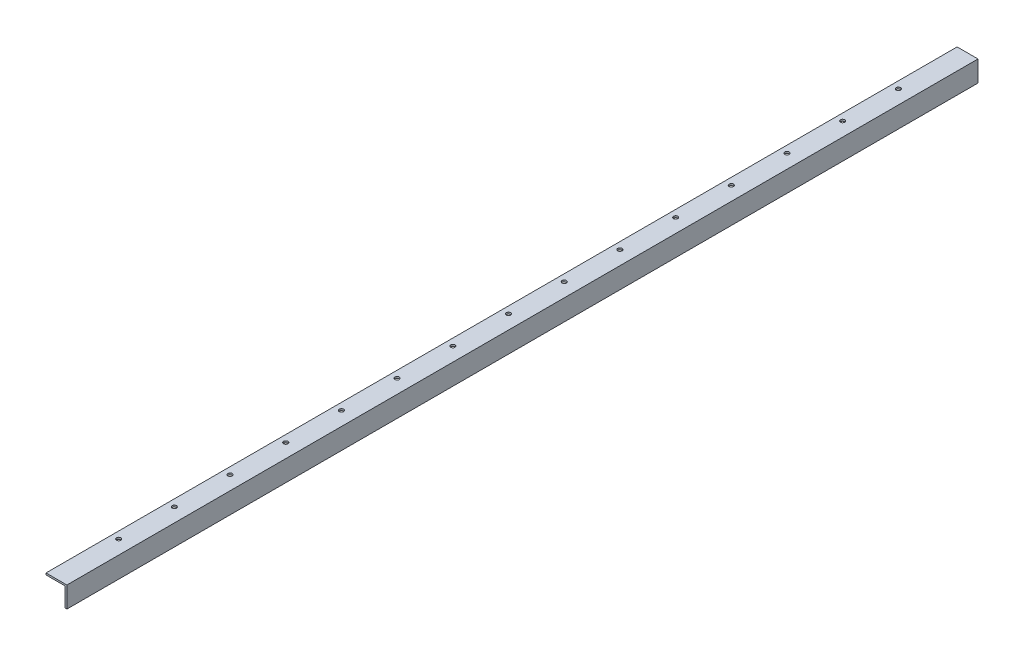
ISO-10303-21;
HEADER;
FILE_DESCRIPTION(('STEP AP214'),'2;1');
FILE_NAME('part.step','',(''),(''),'','','');
FILE_SCHEMA(('AUTOMOTIVE_DESIGN { 1 0 10303 214 1 1 1 1 }'));
ENDSEC;
DATA;
#1=APPLICATION_CONTEXT('core data for automotive mechanical design processes');
#2=APPLICATION_PROTOCOL_DEFINITION('international standard','automotive_design',2000,#1);
#3=PRODUCT_CONTEXT('',#1,'mechanical');
#4=PRODUCT('Part','Part','',(#3));
#5=PRODUCT_RELATED_PRODUCT_CATEGORY('part','',(#4));
#6=PRODUCT_DEFINITION_FORMATION('','',#4);
#7=PRODUCT_DEFINITION_CONTEXT('part definition',#1,'design');
#8=PRODUCT_DEFINITION('design','',#6,#7);
#9=PRODUCT_DEFINITION_SHAPE('','',#8);
#10=(LENGTH_UNIT() NAMED_UNIT(*) SI_UNIT(.MILLI.,.METRE.));
#11=(NAMED_UNIT(*) PLANE_ANGLE_UNIT() SI_UNIT($,.RADIAN.));
#12=(NAMED_UNIT(*) SI_UNIT($,.STERADIAN.) SOLID_ANGLE_UNIT());
#13=UNCERTAINTY_MEASURE_WITH_UNIT(LENGTH_MEASURE(1.E-05),#10,'distance_accuracy_value','');
#14=(GEOMETRIC_REPRESENTATION_CONTEXT(3) GLOBAL_UNCERTAINTY_ASSIGNED_CONTEXT((#13)) GLOBAL_UNIT_ASSIGNED_CONTEXT((#10,
#11,#12)) REPRESENTATION_CONTEXT('',''));
#15=CARTESIAN_POINT('',(0.,0.,0.));
#16=DIRECTION('',(0.,0.,1.));
#17=DIRECTION('',(1.,0.,0.));
#18=AXIS2_PLACEMENT_3D('',#15,#16,#17);
#19=CARTESIAN_POINT('',(-25.4,-41.275,1542.25625));
#20=DIRECTION('',(0.,1.,0.));
#21=DIRECTION('',(0.,0.,1.));
#22=AXIS2_PLACEMENT_3D('',#19,#20,#21);
#23=CYLINDRICAL_SURFACE('',#22,3.96874999999999);
#24=CARTESIAN_POINT('',(-25.4,-3.175,1542.25625));
#25=DIRECTION('',(0.,1.,0.));
#26=DIRECTION('',(0.,0.,1.));
#27=AXIS2_PLACEMENT_3D('',#24,#25,#26);
#28=CIRCLE('',#27,3.96874999999999);
#29=CARTESIAN_POINT('',(-25.4,-3.175,1546.225));
#30=VERTEX_POINT('',#29);
#31=EDGE_CURVE('E41',#30,#30,#28,.T.);
#32=ORIENTED_EDGE('',*,*,#31,.F.);
#33=EDGE_LOOP('',(#32));
#34=FACE_BOUND('',#33,.T.);
#35=CARTESIAN_POINT('',(-25.4,0.,1542.25625));
#36=DIRECTION('',(0.,-1.,0.));
#37=DIRECTION('',(1.,0.,0.));
#38=AXIS2_PLACEMENT_3D('',#35,#36,#37);
#39=CIRCLE('',#38,3.96874999999999);
#40=CARTESIAN_POINT('',(-21.43125,0.,1542.25625));
#41=VERTEX_POINT('',#40);
#42=EDGE_CURVE('E11',#41,#41,#39,.T.);
#43=ORIENTED_EDGE('',*,*,#42,.F.);
#44=EDGE_LOOP('',(#43));
#45=FACE_BOUND('',#44,.T.);
#46=ADVANCED_FACE('F33',(#34,#45),#23,.F.);
#47=CARTESIAN_POINT('',(-25.4,-41.275,1440.65625));
#48=DIRECTION('',(0.,1.,0.));
#49=DIRECTION('',(0.,0.,1.));
#50=AXIS2_PLACEMENT_3D('',#47,#48,#49);
#51=CYLINDRICAL_SURFACE('',#50,3.96874999999999);
#52=CARTESIAN_POINT('',(-25.4,-3.175,1440.65625));
#53=DIRECTION('',(0.,1.,0.));
#54=DIRECTION('',(0.,0.,1.));
#55=AXIS2_PLACEMENT_3D('',#52,#53,#54);
#56=CIRCLE('',#55,3.96874999999999);
#57=CARTESIAN_POINT('',(-25.4,-3.175,1444.625));
#58=VERTEX_POINT('',#57);
#59=EDGE_CURVE('E209',#58,#58,#56,.T.);
#60=ORIENTED_EDGE('',*,*,#59,.F.);
#61=EDGE_LOOP('',(#60));
#62=FACE_BOUND('',#61,.T.);
#63=CARTESIAN_POINT('',(-25.4,0.,1440.65625));
#64=DIRECTION('',(0.,-1.,0.));
#65=DIRECTION('',(1.,0.,0.));
#66=AXIS2_PLACEMENT_3D('',#63,#64,#65);
#67=CIRCLE('',#66,3.96874999999999);
#68=CARTESIAN_POINT('',(-21.43125,0.,1440.65625));
#69=VERTEX_POINT('',#68);
#70=EDGE_CURVE('E212',#69,#69,#67,.T.);
#71=ORIENTED_EDGE('',*,*,#70,.F.);
#72=EDGE_LOOP('',(#71));
#73=FACE_BOUND('',#72,.T.);
#74=ADVANCED_FACE('F220',(#62,#73),#51,.F.);
#75=CARTESIAN_POINT('',(-25.4,-41.275,1339.05625));
#76=DIRECTION('',(0.,1.,0.));
#77=DIRECTION('',(0.,0.,1.));
#78=AXIS2_PLACEMENT_3D('',#75,#76,#77);
#79=CYLINDRICAL_SURFACE('',#78,3.96874999999999);
#80=CARTESIAN_POINT('',(-25.4,-3.175,1339.05625));
#81=DIRECTION('',(0.,1.,0.));
#82=DIRECTION('',(0.,0.,1.));
#83=AXIS2_PLACEMENT_3D('',#80,#81,#82);
#84=CIRCLE('',#83,3.96874999999999);
#85=CARTESIAN_POINT('',(-25.4,-3.175,1343.025));
#86=VERTEX_POINT('',#85);
#87=EDGE_CURVE('E203',#86,#86,#84,.T.);
#88=ORIENTED_EDGE('',*,*,#87,.F.);
#89=EDGE_LOOP('',(#88));
#90=FACE_BOUND('',#89,.T.);
#91=CARTESIAN_POINT('',(-25.4,0.,1339.05625));
#92=DIRECTION('',(0.,-1.,0.));
#93=DIRECTION('',(1.,0.,0.));
#94=AXIS2_PLACEMENT_3D('',#91,#92,#93);
#95=CIRCLE('',#94,3.96874999999999);
#96=CARTESIAN_POINT('',(-21.43125,0.,1339.05625));
#97=VERTEX_POINT('',#96);
#98=EDGE_CURVE('E206',#97,#97,#95,.T.);
#99=ORIENTED_EDGE('',*,*,#98,.F.);
#100=EDGE_LOOP('',(#99));
#101=FACE_BOUND('',#100,.T.);
#102=ADVANCED_FACE('F280',(#90,#101),#79,.F.);
#103=CARTESIAN_POINT('',(-25.4,-41.275,1237.45625));
#104=DIRECTION('',(0.,1.,0.));
#105=DIRECTION('',(0.,0.,1.));
#106=AXIS2_PLACEMENT_3D('',#103,#104,#105);
#107=CYLINDRICAL_SURFACE('',#106,3.96874999999999);
#108=CARTESIAN_POINT('',(-25.4,-3.175,1237.45625));
#109=DIRECTION('',(0.,1.,0.));
#110=DIRECTION('',(0.,0.,1.));
#111=AXIS2_PLACEMENT_3D('',#108,#109,#110);
#112=CIRCLE('',#111,3.96874999999999);
#113=CARTESIAN_POINT('',(-25.4,-3.175,1241.425));
#114=VERTEX_POINT('',#113);
#115=EDGE_CURVE('E197',#114,#114,#112,.T.);
#116=ORIENTED_EDGE('',*,*,#115,.F.);
#117=EDGE_LOOP('',(#116));
#118=FACE_BOUND('',#117,.T.);
#119=CARTESIAN_POINT('',(-25.4,0.,1237.45625));
#120=DIRECTION('',(0.,-1.,0.));
#121=DIRECTION('',(1.,0.,0.));
#122=AXIS2_PLACEMENT_3D('',#119,#120,#121);
#123=CIRCLE('',#122,3.96874999999999);
#124=CARTESIAN_POINT('',(-21.43125,0.,1237.45625));
#125=VERTEX_POINT('',#124);
#126=EDGE_CURVE('E200',#125,#125,#123,.T.);
#127=ORIENTED_EDGE('',*,*,#126,.F.);
#128=EDGE_LOOP('',(#127));
#129=FACE_BOUND('',#128,.T.);
#130=ADVANCED_FACE('F276',(#118,#129),#107,.F.);
#131=CARTESIAN_POINT('',(-25.4,-41.275,1135.85625));
#132=DIRECTION('',(0.,1.,0.));
#133=DIRECTION('',(0.,0.,1.));
#134=AXIS2_PLACEMENT_3D('',#131,#132,#133);
#135=CYLINDRICAL_SURFACE('',#134,3.96874999999999);
#136=CARTESIAN_POINT('',(-25.4,-3.175,1135.85625));
#137=DIRECTION('',(0.,1.,0.));
#138=DIRECTION('',(0.,0.,1.));
#139=AXIS2_PLACEMENT_3D('',#136,#137,#138);
#140=CIRCLE('',#139,3.96874999999999);
#141=CARTESIAN_POINT('',(-25.4,-3.175,1139.825));
#142=VERTEX_POINT('',#141);
#143=EDGE_CURVE('E191',#142,#142,#140,.T.);
#144=ORIENTED_EDGE('',*,*,#143,.F.);
#145=EDGE_LOOP('',(#144));
#146=FACE_BOUND('',#145,.T.);
#147=CARTESIAN_POINT('',(-25.4,0.,1135.85625));
#148=DIRECTION('',(0.,-1.,0.));
#149=DIRECTION('',(1.,0.,0.));
#150=AXIS2_PLACEMENT_3D('',#147,#148,#149);
#151=CIRCLE('',#150,3.96874999999999);
#152=CARTESIAN_POINT('',(-21.43125,0.,1135.85625));
#153=VERTEX_POINT('',#152);
#154=EDGE_CURVE('E194',#153,#153,#151,.T.);
#155=ORIENTED_EDGE('',*,*,#154,.F.);
#156=EDGE_LOOP('',(#155));
#157=FACE_BOUND('',#156,.T.);
#158=ADVANCED_FACE('F272',(#146,#157),#135,.F.);
#159=CARTESIAN_POINT('',(-25.4,-41.275,1034.25625));
#160=DIRECTION('',(0.,1.,0.));
#161=DIRECTION('',(0.,0.,1.));
#162=AXIS2_PLACEMENT_3D('',#159,#160,#161);
#163=CYLINDRICAL_SURFACE('',#162,3.96874999999999);
#164=CARTESIAN_POINT('',(-25.4,-3.175,1034.25625));
#165=DIRECTION('',(0.,1.,0.));
#166=DIRECTION('',(0.,0.,1.));
#167=AXIS2_PLACEMENT_3D('',#164,#165,#166);
#168=CIRCLE('',#167,3.96874999999999);
#169=CARTESIAN_POINT('',(-25.4,-3.175,1038.225));
#170=VERTEX_POINT('',#169);
#171=EDGE_CURVE('E185',#170,#170,#168,.T.);
#172=ORIENTED_EDGE('',*,*,#171,.F.);
#173=EDGE_LOOP('',(#172));
#174=FACE_BOUND('',#173,.T.);
#175=CARTESIAN_POINT('',(-25.4,0.,1034.25625));
#176=DIRECTION('',(0.,-1.,0.));
#177=DIRECTION('',(1.,0.,0.));
#178=AXIS2_PLACEMENT_3D('',#175,#176,#177);
#179=CIRCLE('',#178,3.96874999999999);
#180=CARTESIAN_POINT('',(-21.43125,0.,1034.25625));
#181=VERTEX_POINT('',#180);
#182=EDGE_CURVE('E188',#181,#181,#179,.T.);
#183=ORIENTED_EDGE('',*,*,#182,.F.);
#184=EDGE_LOOP('',(#183));
#185=FACE_BOUND('',#184,.T.);
#186=ADVANCED_FACE('F268',(#174,#185),#163,.F.);
#187=CARTESIAN_POINT('',(-25.4,-41.275,932.65625));
#188=DIRECTION('',(0.,1.,0.));
#189=DIRECTION('',(0.,0.,1.));
#190=AXIS2_PLACEMENT_3D('',#187,#188,#189);
#191=CYLINDRICAL_SURFACE('',#190,3.96874999999999);
#192=CARTESIAN_POINT('',(-25.4,-3.175,932.65625));
#193=DIRECTION('',(0.,1.,0.));
#194=DIRECTION('',(0.,0.,1.));
#195=AXIS2_PLACEMENT_3D('',#192,#193,#194);
#196=CIRCLE('',#195,3.96874999999999);
#197=CARTESIAN_POINT('',(-25.4,-3.175,936.625));
#198=VERTEX_POINT('',#197);
#199=EDGE_CURVE('E179',#198,#198,#196,.T.);
#200=ORIENTED_EDGE('',*,*,#199,.F.);
#201=EDGE_LOOP('',(#200));
#202=FACE_BOUND('',#201,.T.);
#203=CARTESIAN_POINT('',(-25.4,0.,932.65625));
#204=DIRECTION('',(0.,-1.,0.));
#205=DIRECTION('',(1.,0.,0.));
#206=AXIS2_PLACEMENT_3D('',#203,#204,#205);
#207=CIRCLE('',#206,3.96874999999999);
#208=CARTESIAN_POINT('',(-21.43125,0.,932.65625));
#209=VERTEX_POINT('',#208);
#210=EDGE_CURVE('E182',#209,#209,#207,.T.);
#211=ORIENTED_EDGE('',*,*,#210,.F.);
#212=EDGE_LOOP('',(#211));
#213=FACE_BOUND('',#212,.T.);
#214=ADVANCED_FACE('F264',(#202,#213),#191,.F.);
#215=CARTESIAN_POINT('',(-25.4,-41.275,831.05625));
#216=DIRECTION('',(0.,1.,0.));
#217=DIRECTION('',(0.,0.,1.));
#218=AXIS2_PLACEMENT_3D('',#215,#216,#217);
#219=CYLINDRICAL_SURFACE('',#218,3.96874999999999);
#220=CARTESIAN_POINT('',(-25.4,-3.175,831.05625));
#221=DIRECTION('',(0.,1.,0.));
#222=DIRECTION('',(0.,0.,1.));
#223=AXIS2_PLACEMENT_3D('',#220,#221,#222);
#224=CIRCLE('',#223,3.96874999999999);
#225=CARTESIAN_POINT('',(-25.4,-3.175,835.025));
#226=VERTEX_POINT('',#225);
#227=EDGE_CURVE('E173',#226,#226,#224,.T.);
#228=ORIENTED_EDGE('',*,*,#227,.F.);
#229=EDGE_LOOP('',(#228));
#230=FACE_BOUND('',#229,.T.);
#231=CARTESIAN_POINT('',(-25.4,0.,831.05625));
#232=DIRECTION('',(0.,-1.,0.));
#233=DIRECTION('',(1.,0.,0.));
#234=AXIS2_PLACEMENT_3D('',#231,#232,#233);
#235=CIRCLE('',#234,3.96874999999999);
#236=CARTESIAN_POINT('',(-21.43125,0.,831.05625));
#237=VERTEX_POINT('',#236);
#238=EDGE_CURVE('E176',#237,#237,#235,.T.);
#239=ORIENTED_EDGE('',*,*,#238,.F.);
#240=EDGE_LOOP('',(#239));
#241=FACE_BOUND('',#240,.T.);
#242=ADVANCED_FACE('F260',(#230,#241),#219,.F.);
#243=CARTESIAN_POINT('',(-25.4,-41.275,729.45625));
#244=DIRECTION('',(0.,1.,0.));
#245=DIRECTION('',(0.,0.,1.));
#246=AXIS2_PLACEMENT_3D('',#243,#244,#245);
#247=CYLINDRICAL_SURFACE('',#246,3.96874999999999);
#248=CARTESIAN_POINT('',(-25.4,-3.175,729.45625));
#249=DIRECTION('',(0.,1.,0.));
#250=DIRECTION('',(0.,0.,1.));
#251=AXIS2_PLACEMENT_3D('',#248,#249,#250);
#252=CIRCLE('',#251,3.96874999999999);
#253=CARTESIAN_POINT('',(-25.4,-3.175,733.425));
#254=VERTEX_POINT('',#253);
#255=EDGE_CURVE('E167',#254,#254,#252,.T.);
#256=ORIENTED_EDGE('',*,*,#255,.F.);
#257=EDGE_LOOP('',(#256));
#258=FACE_BOUND('',#257,.T.);
#259=CARTESIAN_POINT('',(-25.4,0.,729.45625));
#260=DIRECTION('',(0.,-1.,0.));
#261=DIRECTION('',(1.,0.,0.));
#262=AXIS2_PLACEMENT_3D('',#259,#260,#261);
#263=CIRCLE('',#262,3.96874999999999);
#264=CARTESIAN_POINT('',(-21.43125,0.,729.45625));
#265=VERTEX_POINT('',#264);
#266=EDGE_CURVE('E170',#265,#265,#263,.T.);
#267=ORIENTED_EDGE('',*,*,#266,.F.);
#268=EDGE_LOOP('',(#267));
#269=FACE_BOUND('',#268,.T.);
#270=ADVANCED_FACE('F256',(#258,#269),#247,.F.);
#271=CARTESIAN_POINT('',(-25.4,-41.275,627.85625));
#272=DIRECTION('',(0.,1.,0.));
#273=DIRECTION('',(0.,0.,1.));
#274=AXIS2_PLACEMENT_3D('',#271,#272,#273);
#275=CYLINDRICAL_SURFACE('',#274,3.96874999999999);
#276=CARTESIAN_POINT('',(-25.4,-3.175,627.85625));
#277=DIRECTION('',(0.,1.,0.));
#278=DIRECTION('',(0.,0.,1.));
#279=AXIS2_PLACEMENT_3D('',#276,#277,#278);
#280=CIRCLE('',#279,3.96874999999999);
#281=CARTESIAN_POINT('',(-25.4,-3.175,631.825));
#282=VERTEX_POINT('',#281);
#283=EDGE_CURVE('E161',#282,#282,#280,.T.);
#284=ORIENTED_EDGE('',*,*,#283,.F.);
#285=EDGE_LOOP('',(#284));
#286=FACE_BOUND('',#285,.T.);
#287=CARTESIAN_POINT('',(-25.4,0.,627.85625));
#288=DIRECTION('',(0.,-1.,0.));
#289=DIRECTION('',(1.,0.,0.));
#290=AXIS2_PLACEMENT_3D('',#287,#288,#289);
#291=CIRCLE('',#290,3.96874999999999);
#292=CARTESIAN_POINT('',(-21.43125,0.,627.85625));
#293=VERTEX_POINT('',#292);
#294=EDGE_CURVE('E164',#293,#293,#291,.T.);
#295=ORIENTED_EDGE('',*,*,#294,.F.);
#296=EDGE_LOOP('',(#295));
#297=FACE_BOUND('',#296,.T.);
#298=ADVANCED_FACE('F252',(#286,#297),#275,.F.);
#299=CARTESIAN_POINT('',(-25.4,-41.275,526.25625));
#300=DIRECTION('',(0.,1.,0.));
#301=DIRECTION('',(0.,0.,1.));
#302=AXIS2_PLACEMENT_3D('',#299,#300,#301);
#303=CYLINDRICAL_SURFACE('',#302,3.96874999999999);
#304=CARTESIAN_POINT('',(-25.4,-3.175,526.25625));
#305=DIRECTION('',(0.,1.,0.));
#306=DIRECTION('',(0.,0.,1.));
#307=AXIS2_PLACEMENT_3D('',#304,#305,#306);
#308=CIRCLE('',#307,3.96874999999999);
#309=CARTESIAN_POINT('',(-25.4,-3.175,530.225));
#310=VERTEX_POINT('',#309);
#311=EDGE_CURVE('E155',#310,#310,#308,.T.);
#312=ORIENTED_EDGE('',*,*,#311,.F.);
#313=EDGE_LOOP('',(#312));
#314=FACE_BOUND('',#313,.T.);
#315=CARTESIAN_POINT('',(-25.4,0.,526.25625));
#316=DIRECTION('',(0.,-1.,0.));
#317=DIRECTION('',(1.,0.,0.));
#318=AXIS2_PLACEMENT_3D('',#315,#316,#317);
#319=CIRCLE('',#318,3.96874999999999);
#320=CARTESIAN_POINT('',(-21.43125,0.,526.25625));
#321=VERTEX_POINT('',#320);
#322=EDGE_CURVE('E158',#321,#321,#319,.T.);
#323=ORIENTED_EDGE('',*,*,#322,.F.);
#324=EDGE_LOOP('',(#323));
#325=FACE_BOUND('',#324,.T.);
#326=ADVANCED_FACE('F248',(#314,#325),#303,.F.);
#327=CARTESIAN_POINT('',(-25.4,-41.275,424.65625));
#328=DIRECTION('',(0.,1.,0.));
#329=DIRECTION('',(0.,0.,1.));
#330=AXIS2_PLACEMENT_3D('',#327,#328,#329);
#331=CYLINDRICAL_SURFACE('',#330,3.96874999999999);
#332=CARTESIAN_POINT('',(-25.4,-3.175,424.65625));
#333=DIRECTION('',(0.,1.,0.));
#334=DIRECTION('',(0.,0.,1.));
#335=AXIS2_PLACEMENT_3D('',#332,#333,#334);
#336=CIRCLE('',#335,3.96874999999999);
#337=CARTESIAN_POINT('',(-25.4,-3.175,428.625));
#338=VERTEX_POINT('',#337);
#339=EDGE_CURVE('E149',#338,#338,#336,.T.);
#340=ORIENTED_EDGE('',*,*,#339,.F.);
#341=EDGE_LOOP('',(#340));
#342=FACE_BOUND('',#341,.T.);
#343=CARTESIAN_POINT('',(-25.4,0.,424.65625));
#344=DIRECTION('',(0.,-1.,0.));
#345=DIRECTION('',(1.,0.,0.));
#346=AXIS2_PLACEMENT_3D('',#343,#344,#345);
#347=CIRCLE('',#346,3.96874999999999);
#348=CARTESIAN_POINT('',(-21.43125,0.,424.65625));
#349=VERTEX_POINT('',#348);
#350=EDGE_CURVE('E152',#349,#349,#347,.T.);
#351=ORIENTED_EDGE('',*,*,#350,.F.);
#352=EDGE_LOOP('',(#351));
#353=FACE_BOUND('',#352,.T.);
#354=ADVANCED_FACE('F244',(#342,#353),#331,.F.);
#355=CARTESIAN_POINT('',(-25.4,-41.275,323.05625));
#356=DIRECTION('',(0.,1.,0.));
#357=DIRECTION('',(0.,0.,1.));
#358=AXIS2_PLACEMENT_3D('',#355,#356,#357);
#359=CYLINDRICAL_SURFACE('',#358,3.96874999999999);
#360=CARTESIAN_POINT('',(-25.4,-3.175,323.05625));
#361=DIRECTION('',(0.,1.,0.));
#362=DIRECTION('',(0.,0.,1.));
#363=AXIS2_PLACEMENT_3D('',#360,#361,#362);
#364=CIRCLE('',#363,3.96874999999999);
#365=CARTESIAN_POINT('',(-25.4,-3.175,327.025));
#366=VERTEX_POINT('',#365);
#367=EDGE_CURVE('E139',#366,#366,#364,.T.);
#368=ORIENTED_EDGE('',*,*,#367,.F.);
#369=EDGE_LOOP('',(#368));
#370=FACE_BOUND('',#369,.T.);
#371=CARTESIAN_POINT('',(-25.4,0.,323.05625));
#372=DIRECTION('',(0.,-1.,0.));
#373=DIRECTION('',(1.,0.,0.));
#374=AXIS2_PLACEMENT_3D('',#371,#372,#373);
#375=CIRCLE('',#374,3.96874999999999);
#376=CARTESIAN_POINT('',(-21.43125,0.,323.05625));
#377=VERTEX_POINT('',#376);
#378=EDGE_CURVE('E146',#377,#377,#375,.T.);
#379=ORIENTED_EDGE('',*,*,#378,.F.);
#380=EDGE_LOOP('',(#379));
#381=FACE_BOUND('',#380,.T.);
#382=ADVANCED_FACE('F235',(#370,#381),#359,.F.);
#383=CARTESIAN_POINT('',(0.,-38.1,1662.1125));
#384=DIRECTION('',(-1.,0.,0.));
#385=DIRECTION('',(0.,0.,1.));
#386=AXIS2_PLACEMENT_3D('',#383,#384,#385);
#387=PLANE('',#386);
#388=DIRECTION('',(0.,1.,0.));
#389=VECTOR('',#388,1.);
#390=CARTESIAN_POINT('',(0.,-38.1,0.));
#391=LINE('',#390,#389);
#392=CARTESIAN_POINT('',(0.,-38.1,0.));
#393=VERTEX_POINT('',#392);
#394=CARTESIAN_POINT('',(0.,0.,0.));
#395=VERTEX_POINT('',#394);
#396=EDGE_CURVE('E119',#393,#395,#391,.T.);
#397=ORIENTED_EDGE('',*,*,#396,.T.);
#398=DIRECTION('',(0.,0.,-1.));
#399=VECTOR('',#398,1.);
#400=CARTESIAN_POINT('',(0.,0.,1662.1125));
#401=LINE('',#400,#399);
#402=CARTESIAN_POINT('',(0.,0.,1662.1125));
#403=VERTEX_POINT('',#402);
#404=EDGE_CURVE('E137',#403,#395,#401,.T.);
#405=ORIENTED_EDGE('',*,*,#404,.F.);
#406=DIRECTION('',(0.,1.,0.));
#407=VECTOR('',#406,1.);
#408=CARTESIAN_POINT('',(0.,-38.1,1662.1125));
#409=LINE('',#408,#407);
#410=CARTESIAN_POINT('',(0.,-38.1,1662.1125));
#411=VERTEX_POINT('',#410);
#412=EDGE_CURVE('E130',#411,#403,#409,.T.);
#413=ORIENTED_EDGE('',*,*,#412,.F.);
#414=DIRECTION('',(0.,0.,-1.));
#415=VECTOR('',#414,1.);
#416=CARTESIAN_POINT('',(0.,-38.1,1662.1125));
#417=LINE('',#416,#415);
#418=EDGE_CURVE('E115',#411,#393,#417,.T.);
#419=ORIENTED_EDGE('',*,*,#418,.T.);
#420=EDGE_LOOP('',(#397,#405,#413,#419));
#421=FACE_BOUND('',#420,.T.);
#422=ADVANCED_FACE('F226',(#421),#387,.F.);
#423=CARTESIAN_POINT('',(0.,0.,1662.1125));
#424=DIRECTION('',(0.,-1.,0.));
#425=DIRECTION('',(1.,0.,0.));
#426=AXIS2_PLACEMENT_3D('',#423,#424,#425);
#427=PLANE('',#426);
#428=CARTESIAN_POINT('',(-25.4,0.,221.45625));
#429=DIRECTION('',(0.,-1.,0.));
#430=DIRECTION('',(1.,0.,0.));
#431=AXIS2_PLACEMENT_3D('',#428,#429,#430);
#432=CIRCLE('',#431,3.96874999999999);
#433=CARTESIAN_POINT('',(-21.43125,0.,221.45625));
#434=VERTEX_POINT('',#433);
#435=EDGE_CURVE('E143',#434,#434,#432,.T.);
#436=ORIENTED_EDGE('',*,*,#435,.T.);
#437=EDGE_LOOP('',(#436));
#438=FACE_BOUND('',#437,.T.);
#439=CARTESIAN_POINT('',(-25.4,0.,119.85625));
#440=DIRECTION('',(0.,-1.,0.));
#441=DIRECTION('',(1.,0.,0.));
#442=AXIS2_PLACEMENT_3D('',#439,#440,#441);
#443=CIRCLE('',#442,3.96874999999999);
#444=CARTESIAN_POINT('',(-21.43125,0.,119.85625));
#445=VERTEX_POINT('',#444);
#446=EDGE_CURVE('E123',#445,#445,#443,.T.);
#447=ORIENTED_EDGE('',*,*,#446,.T.);
#448=EDGE_LOOP('',(#447));
#449=FACE_BOUND('',#448,.T.);
#450=DIRECTION('',(-1.,0.,0.));
#451=VECTOR('',#450,1.);
#452=CARTESIAN_POINT('',(0.,0.,0.));
#453=LINE('',#452,#451);
#454=CARTESIAN_POINT('',(-38.1,0.,0.));
#455=VERTEX_POINT('',#454);
#456=EDGE_CURVE('E122',#395,#455,#453,.T.);
#457=ORIENTED_EDGE('',*,*,#456,.T.);
#458=DIRECTION('',(0.,0.,-1.));
#459=VECTOR('',#458,1.);
#460=CARTESIAN_POINT('',(-38.1,0.,1662.1125));
#461=LINE('',#460,#459);
#462=CARTESIAN_POINT('',(-38.1,0.,1662.1125));
#463=VERTEX_POINT('',#462);
#464=EDGE_CURVE('E134',#463,#455,#461,.T.);
#465=ORIENTED_EDGE('',*,*,#464,.F.);
#466=DIRECTION('',(-1.,0.,0.));
#467=VECTOR('',#466,1.);
#468=CARTESIAN_POINT('',(0.,0.,1662.1125));
#469=LINE('',#468,#467);
#470=EDGE_CURVE('E87',#403,#463,#469,.T.);
#471=ORIENTED_EDGE('',*,*,#470,.F.);
#472=ORIENTED_EDGE('',*,*,#404,.T.);
#473=EDGE_LOOP('',(#457,#465,#471,#472));
#474=FACE_BOUND('',#473,.T.);
#475=ORIENTED_EDGE('',*,*,#378,.T.);
#476=EDGE_LOOP('',(#475));
#477=FACE_BOUND('',#476,.T.);
#478=ORIENTED_EDGE('',*,*,#350,.T.);
#479=EDGE_LOOP('',(#478));
#480=FACE_BOUND('',#479,.T.);
#481=ORIENTED_EDGE('',*,*,#322,.T.);
#482=EDGE_LOOP('',(#481));
#483=FACE_BOUND('',#482,.T.);
#484=ORIENTED_EDGE('',*,*,#294,.T.);
#485=EDGE_LOOP('',(#484));
#486=FACE_BOUND('',#485,.T.);
#487=ORIENTED_EDGE('',*,*,#266,.T.);
#488=EDGE_LOOP('',(#487));
#489=FACE_BOUND('',#488,.T.);
#490=ORIENTED_EDGE('',*,*,#238,.T.);
#491=EDGE_LOOP('',(#490));
#492=FACE_BOUND('',#491,.T.);
#493=ORIENTED_EDGE('',*,*,#210,.T.);
#494=EDGE_LOOP('',(#493));
#495=FACE_BOUND('',#494,.T.);
#496=ORIENTED_EDGE('',*,*,#182,.T.);
#497=EDGE_LOOP('',(#496));
#498=FACE_BOUND('',#497,.T.);
#499=ORIENTED_EDGE('',*,*,#154,.T.);
#500=EDGE_LOOP('',(#499));
#501=FACE_BOUND('',#500,.T.);
#502=ORIENTED_EDGE('',*,*,#126,.T.);
#503=EDGE_LOOP('',(#502));
#504=FACE_BOUND('',#503,.T.);
#505=ORIENTED_EDGE('',*,*,#98,.T.);
#506=EDGE_LOOP('',(#505));
#507=FACE_BOUND('',#506,.T.);
#508=ORIENTED_EDGE('',*,*,#70,.T.);
#509=EDGE_LOOP('',(#508));
#510=FACE_BOUND('',#509,.T.);
#511=ORIENTED_EDGE('',*,*,#42,.T.);
#512=EDGE_LOOP('',(#511));
#513=FACE_BOUND('',#512,.T.);
#514=ADVANCED_FACE('F223',(#438,#449,#474,#477,#480,#483,#486,#489,#492,#495,#498,#501,#504,
#507,#510,#513),#427,.F.);
#515=CARTESIAN_POINT('',(-38.1,0.,1662.1125));
#516=DIRECTION('',(1.,0.,0.));
#517=DIRECTION('',(0.,0.,-1.));
#518=AXIS2_PLACEMENT_3D('',#515,#516,#517);
#519=PLANE('',#518);
#520=DIRECTION('',(0.,-1.,0.));
#521=VECTOR('',#520,1.);
#522=CARTESIAN_POINT('',(-38.1,0.,0.));
#523=LINE('',#522,#521);
#524=CARTESIAN_POINT('',(-38.1,-3.17500000000001,0.));
#525=VERTEX_POINT('',#524);
#526=EDGE_CURVE('E125',#455,#525,#523,.T.);
#527=ORIENTED_EDGE('',*,*,#526,.T.);
#528=DIRECTION('',(0.,0.,-1.));
#529=VECTOR('',#528,1.);
#530=CARTESIAN_POINT('',(-38.1,-3.17500000000001,1662.1125));
#531=LINE('',#530,#529);
#532=CARTESIAN_POINT('',(-38.1,-3.17500000000001,1662.1125));
#533=VERTEX_POINT('',#532);
#534=EDGE_CURVE('E110',#533,#525,#531,.T.);
#535=ORIENTED_EDGE('',*,*,#534,.F.);
#536=DIRECTION('',(0.,-1.,0.));
#537=VECTOR('',#536,1.);
#538=CARTESIAN_POINT('',(-38.1,0.,1662.1125));
#539=LINE('',#538,#537);
#540=EDGE_CURVE('E100',#463,#533,#539,.T.);
#541=ORIENTED_EDGE('',*,*,#540,.F.);
#542=ORIENTED_EDGE('',*,*,#464,.T.);
#543=EDGE_LOOP('',(#527,#535,#541,#542));
#544=FACE_BOUND('',#543,.T.);
#545=ADVANCED_FACE('F225',(#544),#519,.F.);
#546=CARTESIAN_POINT('',(-38.1,-3.17500000000001,1662.1125));
#547=DIRECTION('',(0.,1.,0.));
#548=DIRECTION('',(0.,0.,1.));
#549=AXIS2_PLACEMENT_3D('',#546,#547,#548);
#550=PLANE('',#549);
#551=CARTESIAN_POINT('',(-25.4,-3.175,221.45625));
#552=DIRECTION('',(0.,1.,0.));
#553=DIRECTION('',(0.,0.,1.));
#554=AXIS2_PLACEMENT_3D('',#551,#552,#553);
#555=CIRCLE('',#554,3.96874999999999);
#556=CARTESIAN_POINT('',(-25.4,-3.175,225.425));
#557=VERTEX_POINT('',#556);
#558=EDGE_CURVE('E322',#557,#557,#555,.T.);
#559=ORIENTED_EDGE('',*,*,#558,.T.);
#560=EDGE_LOOP('',(#559));
#561=FACE_BOUND('',#560,.T.);
#562=CARTESIAN_POINT('',(-25.4,-3.175,119.85625));
#563=DIRECTION('',(0.,1.,0.));
#564=DIRECTION('',(0.,0.,1.));
#565=AXIS2_PLACEMENT_3D('',#562,#563,#564);
#566=CIRCLE('',#565,3.96874999999999);
#567=CARTESIAN_POINT('',(-25.4,-3.175,123.825));
#568=VERTEX_POINT('',#567);
#569=EDGE_CURVE('E140',#568,#568,#566,.T.);
#570=ORIENTED_EDGE('',*,*,#569,.T.);
#571=EDGE_LOOP('',(#570));
#572=FACE_BOUND('',#571,.T.);
#573=DIRECTION('',(1.,0.,0.));
#574=VECTOR('',#573,1.);
#575=CARTESIAN_POINT('',(-38.1,-3.17500000000001,0.));
#576=LINE('',#575,#574);
#577=CARTESIAN_POINT('',(-3.17500000000001,-3.17500000000001,0.));
#578=VERTEX_POINT('',#577);
#579=EDGE_CURVE('E109',#525,#578,#576,.T.);
#580=ORIENTED_EDGE('',*,*,#579,.T.);
#581=DIRECTION('',(0.,0.,-1.));
#582=VECTOR('',#581,1.);
#583=CARTESIAN_POINT('',(-3.17500000000001,-3.17500000000001,1662.1125));
#584=LINE('',#583,#582);
#585=CARTESIAN_POINT('',(-3.17500000000001,-3.17500000000001,1662.1125));
#586=VERTEX_POINT('',#585);
#587=EDGE_CURVE('E105',#586,#578,#584,.T.);
#588=ORIENTED_EDGE('',*,*,#587,.F.);
#589=DIRECTION('',(1.,0.,0.));
#590=VECTOR('',#589,1.);
#591=CARTESIAN_POINT('',(-38.1,-3.17500000000001,1662.1125));
#592=LINE('',#591,#590);
#593=EDGE_CURVE('E94',#533,#586,#592,.T.);
#594=ORIENTED_EDGE('',*,*,#593,.F.);
#595=ORIENTED_EDGE('',*,*,#534,.T.);
#596=EDGE_LOOP('',(#580,#588,#594,#595));
#597=FACE_BOUND('',#596,.T.);
#598=ORIENTED_EDGE('',*,*,#367,.T.);
#599=EDGE_LOOP('',(#598));
#600=FACE_BOUND('',#599,.T.);
#601=ORIENTED_EDGE('',*,*,#339,.T.);
#602=EDGE_LOOP('',(#601));
#603=FACE_BOUND('',#602,.T.);
#604=ORIENTED_EDGE('',*,*,#311,.T.);
#605=EDGE_LOOP('',(#604));
#606=FACE_BOUND('',#605,.T.);
#607=ORIENTED_EDGE('',*,*,#283,.T.);
#608=EDGE_LOOP('',(#607));
#609=FACE_BOUND('',#608,.T.);
#610=ORIENTED_EDGE('',*,*,#255,.T.);
#611=EDGE_LOOP('',(#610));
#612=FACE_BOUND('',#611,.T.);
#613=ORIENTED_EDGE('',*,*,#227,.T.);
#614=EDGE_LOOP('',(#613));
#615=FACE_BOUND('',#614,.T.);
#616=ORIENTED_EDGE('',*,*,#199,.T.);
#617=EDGE_LOOP('',(#616));
#618=FACE_BOUND('',#617,.T.);
#619=ORIENTED_EDGE('',*,*,#171,.T.);
#620=EDGE_LOOP('',(#619));
#621=FACE_BOUND('',#620,.T.);
#622=ORIENTED_EDGE('',*,*,#143,.T.);
#623=EDGE_LOOP('',(#622));
#624=FACE_BOUND('',#623,.T.);
#625=ORIENTED_EDGE('',*,*,#115,.T.);
#626=EDGE_LOOP('',(#625));
#627=FACE_BOUND('',#626,.T.);
#628=ORIENTED_EDGE('',*,*,#87,.T.);
#629=EDGE_LOOP('',(#628));
#630=FACE_BOUND('',#629,.T.);
#631=ORIENTED_EDGE('',*,*,#59,.T.);
#632=EDGE_LOOP('',(#631));
#633=FACE_BOUND('',#632,.T.);
#634=ORIENTED_EDGE('',*,*,#31,.T.);
#635=EDGE_LOOP('',(#634));
#636=FACE_BOUND('',#635,.T.);
#637=ADVANCED_FACE('F106',(#561,#572,#597,#600,#603,#606,#609,#612,#615,#618,#621,#624,#627,
#630,#633,#636),#550,.F.);
#638=CARTESIAN_POINT('',(-3.17500000000001,-3.17500000000001,1662.1125));
#639=DIRECTION('',(1.,0.,0.));
#640=DIRECTION('',(0.,1.,0.));
#641=AXIS2_PLACEMENT_3D('',#638,#639,#640);
#642=PLANE('',#641);
#643=DIRECTION('',(0.,-1.,0.));
#644=VECTOR('',#643,1.);
#645=CARTESIAN_POINT('',(-3.17500000000001,-3.17500000000001,0.));
#646=LINE('',#645,#644);
#647=CARTESIAN_POINT('',(-3.175,-38.1,0.));
#648=VERTEX_POINT('',#647);
#649=EDGE_CURVE('E72',#578,#648,#646,.T.);
#650=ORIENTED_EDGE('',*,*,#649,.T.);
#651=DIRECTION('',(0.,0.,-1.));
#652=VECTOR('',#651,1.);
#653=CARTESIAN_POINT('',(-3.175,-38.1,1662.1125));
#654=LINE('',#653,#652);
#655=CARTESIAN_POINT('',(-3.175,-38.1,1662.1125));
#656=VERTEX_POINT('',#655);
#657=EDGE_CURVE('E111',#656,#648,#654,.T.);
#658=ORIENTED_EDGE('',*,*,#657,.F.);
#659=DIRECTION('',(0.,-1.,0.));
#660=VECTOR('',#659,1.);
#661=CARTESIAN_POINT('',(-3.17500000000001,-3.17500000000001,1662.1125));
#662=LINE('',#661,#660);
#663=EDGE_CURVE('E98',#586,#656,#662,.T.);
#664=ORIENTED_EDGE('',*,*,#663,.F.);
#665=ORIENTED_EDGE('',*,*,#587,.T.);
#666=EDGE_LOOP('',(#650,#658,#664,#665));
#667=FACE_BOUND('',#666,.T.);
#668=ADVANCED_FACE('F113',(#667),#642,.F.);
#669=CARTESIAN_POINT('',(-3.175,-38.1,1662.1125));
#670=DIRECTION('',(0.,1.,0.));
#671=DIRECTION('',(0.,0.,1.));
#672=AXIS2_PLACEMENT_3D('',#669,#670,#671);
#673=PLANE('',#672);
#674=DIRECTION('',(1.,0.,0.));
#675=VECTOR('',#674,1.);
#676=CARTESIAN_POINT('',(-3.175,-38.1,0.));
#677=LINE('',#676,#675);
#678=EDGE_CURVE('E78',#648,#393,#677,.T.);
#679=ORIENTED_EDGE('',*,*,#678,.T.);
#680=ORIENTED_EDGE('',*,*,#418,.F.);
#681=DIRECTION('',(1.,0.,0.));
#682=VECTOR('',#681,1.);
#683=CARTESIAN_POINT('',(-3.175,-38.1,1662.1125));
#684=LINE('',#683,#682);
#685=EDGE_CURVE('E49',#656,#411,#684,.T.);
#686=ORIENTED_EDGE('',*,*,#685,.F.);
#687=ORIENTED_EDGE('',*,*,#657,.T.);
#688=EDGE_LOOP('',(#679,#680,#686,#687));
#689=FACE_BOUND('',#688,.T.);
#690=ADVANCED_FACE('F298',(#689),#673,.F.);
#691=CARTESIAN_POINT('',(0.,0.,1662.1125));
#692=DIRECTION('',(0.,0.,1.));
#693=DIRECTION('',(1.,0.,0.));
#694=AXIS2_PLACEMENT_3D('',#691,#692,#693);
#695=PLANE('',#694);
#696=ORIENTED_EDGE('',*,*,#412,.T.);
#697=ORIENTED_EDGE('',*,*,#470,.T.);
#698=ORIENTED_EDGE('',*,*,#540,.T.);
#699=ORIENTED_EDGE('',*,*,#593,.T.);
#700=ORIENTED_EDGE('',*,*,#663,.T.);
#701=ORIENTED_EDGE('',*,*,#685,.T.);
#702=EDGE_LOOP('',(#696,#697,#698,#699,#700,#701));
#703=FACE_BOUND('',#702,.T.);
#704=ADVANCED_FACE('F96',(#703),#695,.T.);
#705=CARTESIAN_POINT('',(0.,0.,0.));
#706=DIRECTION('',(0.,0.,1.));
#707=DIRECTION('',(1.,0.,0.));
#708=AXIS2_PLACEMENT_3D('',#705,#706,#707);
#709=PLANE('',#708);
#710=ORIENTED_EDGE('',*,*,#396,.F.);
#711=ORIENTED_EDGE('',*,*,#678,.F.);
#712=ORIENTED_EDGE('',*,*,#649,.F.);
#713=ORIENTED_EDGE('',*,*,#579,.F.);
#714=ORIENTED_EDGE('',*,*,#526,.F.);
#715=ORIENTED_EDGE('',*,*,#456,.F.);
#716=EDGE_LOOP('',(#710,#711,#712,#713,#714,#715));
#717=FACE_BOUND('',#716,.T.);
#718=ADVANCED_FACE('F305',(#717),#709,.F.);
#719=CARTESIAN_POINT('',(-25.4,-41.275,119.85625));
#720=DIRECTION('',(0.,1.,0.));
#721=DIRECTION('',(0.,0.,1.));
#722=AXIS2_PLACEMENT_3D('',#719,#720,#721);
#723=CYLINDRICAL_SURFACE('',#722,3.96874999999999);
#724=ORIENTED_EDGE('',*,*,#569,.F.);
#725=EDGE_LOOP('',(#724));
#726=FACE_BOUND('',#725,.T.);
#727=ORIENTED_EDGE('',*,*,#446,.F.);
#728=EDGE_LOOP('',(#727));
#729=FACE_BOUND('',#728,.T.);
#730=ADVANCED_FACE('F308',(#726,#729),#723,.F.);
#731=CARTESIAN_POINT('',(-25.4,-41.275,221.45625));
#732=DIRECTION('',(0.,1.,0.));
#733=DIRECTION('',(0.,0.,1.));
#734=AXIS2_PLACEMENT_3D('',#731,#732,#733);
#735=CYLINDRICAL_SURFACE('',#734,3.96874999999999);
#736=ORIENTED_EDGE('',*,*,#558,.F.);
#737=EDGE_LOOP('',(#736));
#738=FACE_BOUND('',#737,.T.);
#739=ORIENTED_EDGE('',*,*,#435,.F.);
#740=EDGE_LOOP('',(#739));
#741=FACE_BOUND('',#740,.T.);
#742=ADVANCED_FACE('F314',(#738,#741),#735,.F.);
#743=CLOSED_SHELL('',(#46,#74,#102,#130,#158,#186,#214,#242,#270,#298,#326,#354,#382,#422,#514,
#545,#637,#668,#690,#704,#718,#730,#742));
#744=MANIFOLD_SOLID_BREP('B2',#743);
#745=ADVANCED_BREP_SHAPE_REPRESENTATION('',(#18,#744),#14);
#746=SHAPE_DEFINITION_REPRESENTATION(#9,#745);
ENDSEC;
END-ISO-10303-21;
